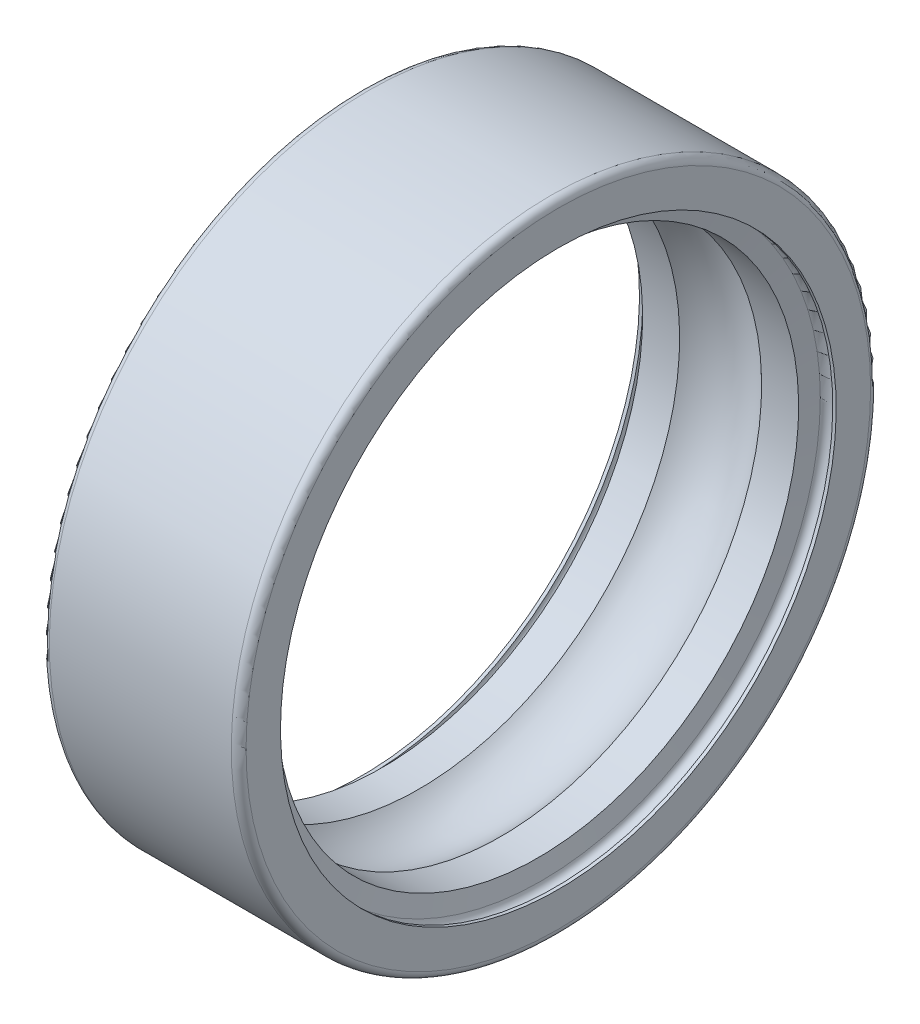
ISO-10303-21;
HEADER;
FILE_DESCRIPTION(('STEP AP214'),'2;1');
FILE_NAME('part.step','',(''),(''),'','','');
FILE_SCHEMA(('AUTOMOTIVE_DESIGN { 1 0 10303 214 1 1 1 1 }'));
ENDSEC;
DATA;
#1=APPLICATION_CONTEXT('core data for automotive mechanical design processes');
#2=APPLICATION_PROTOCOL_DEFINITION('international standard','automotive_design',2000,#1);
#3=PRODUCT_CONTEXT('',#1,'mechanical');
#4=PRODUCT('Part','Part','',(#3));
#5=PRODUCT_RELATED_PRODUCT_CATEGORY('part','',(#4));
#6=PRODUCT_DEFINITION_FORMATION('','',#4);
#7=PRODUCT_DEFINITION_CONTEXT('part definition',#1,'design');
#8=PRODUCT_DEFINITION('design','',#6,#7);
#9=PRODUCT_DEFINITION_SHAPE('','',#8);
#10=(LENGTH_UNIT() NAMED_UNIT(*) SI_UNIT(.MILLI.,.METRE.));
#11=(NAMED_UNIT(*) PLANE_ANGLE_UNIT() SI_UNIT($,.RADIAN.));
#12=(NAMED_UNIT(*) SI_UNIT($,.STERADIAN.) SOLID_ANGLE_UNIT());
#13=UNCERTAINTY_MEASURE_WITH_UNIT(LENGTH_MEASURE(1.E-05),#10,'distance_accuracy_value','');
#14=(GEOMETRIC_REPRESENTATION_CONTEXT(3) GLOBAL_UNCERTAINTY_ASSIGNED_CONTEXT((#13)) GLOBAL_UNIT_ASSIGNED_CONTEXT((#10,
#11,#12)) REPRESENTATION_CONTEXT('',''));
#15=CARTESIAN_POINT('',(0.,0.,0.));
#16=DIRECTION('',(0.,0.,1.));
#17=DIRECTION('',(1.,0.,0.));
#18=AXIS2_PLACEMENT_3D('',#15,#16,#17);
#19=CARTESIAN_POINT('',(7.58,0.,0.));
#20=DIRECTION('',(1.,0.,0.));
#21=DIRECTION('',(0.,0.,-1.));
#22=AXIS2_PLACEMENT_3D('',#19,#20,#21);
#23=TOROIDAL_SURFACE('',#22,11.3,0.28);
#24=CARTESIAN_POINT('',(7.86,0.,0.));
#25=DIRECTION('',(1.,0.,0.));
#26=DIRECTION('',(0.,1.,0.));
#27=AXIS2_PLACEMENT_3D('',#24,#25,#26);
#28=CIRCLE('',#27,11.3);
#29=CARTESIAN_POINT('',(7.86,11.3,0.));
#30=VERTEX_POINT('',#29);
#31=EDGE_CURVE('E11',#30,#30,#28,.T.);
#32=ORIENTED_EDGE('',*,*,#31,.T.);
#33=EDGE_LOOP('',(#32));
#34=FACE_BOUND('',#33,.T.);
#35=CARTESIAN_POINT('',(7.30425382915658,0.,0.));
#36=DIRECTION('',(1.,0.,0.));
#37=DIRECTION('',(0.,1.,0.));
#38=AXIS2_PLACEMENT_3D('',#35,#36,#37);
#39=CIRCLE('',#38,11.3486214897467);
#40=CARTESIAN_POINT('',(7.30425382915658,11.3486214897467,0.));
#41=VERTEX_POINT('',#40);
#42=EDGE_CURVE('E67',#41,#41,#39,.T.);
#43=ORIENTED_EDGE('',*,*,#42,.F.);
#44=EDGE_LOOP('',(#43));
#45=FACE_BOUND('',#44,.T.);
#46=ADVANCED_FACE('F16',(#34,#45),#23,.F.);
#47=CARTESIAN_POINT('',(7.93,0.,0.));
#48=DIRECTION('',(-1.,0.,0.));
#49=DIRECTION('',(0.,1.,0.));
#50=AXIS2_PLACEMENT_3D('',#47,#48,#49);
#51=CYLINDRICAL_SURFACE('',#50,11.3);
#52=CARTESIAN_POINT('',(8.,0.,0.));
#53=DIRECTION('',(1.,0.,0.));
#54=DIRECTION('',(0.,1.,0.));
#55=AXIS2_PLACEMENT_3D('',#52,#53,#54);
#56=CIRCLE('',#55,11.3);
#57=CARTESIAN_POINT('',(8.,11.3,0.));
#58=VERTEX_POINT('',#57);
#59=EDGE_CURVE('E26',#58,#58,#56,.T.);
#60=ORIENTED_EDGE('',*,*,#59,.T.);
#61=EDGE_LOOP('',(#60));
#62=FACE_BOUND('',#61,.T.);
#63=ORIENTED_EDGE('',*,*,#31,.F.);
#64=EDGE_LOOP('',(#63));
#65=FACE_BOUND('',#64,.T.);
#66=ADVANCED_FACE('F96',(#62,#65),#51,.F.);
#67=CARTESIAN_POINT('',(8.,12.,0.));
#68=DIRECTION('',(1.,0.,0.));
#69=DIRECTION('',(0.,1.,0.));
#70=AXIS2_PLACEMENT_3D('',#67,#68,#69);
#71=PLANE('',#70);
#72=CARTESIAN_POINT('',(8.,0.,0.));
#73=DIRECTION('',(1.,0.,0.));
#74=DIRECTION('',(0.,1.,0.));
#75=AXIS2_PLACEMENT_3D('',#72,#73,#74);
#76=CIRCLE('',#75,12.7);
#77=CARTESIAN_POINT('',(8.,12.7,0.));
#78=VERTEX_POINT('',#77);
#79=EDGE_CURVE('E91',#78,#78,#76,.T.);
#80=ORIENTED_EDGE('',*,*,#79,.T.);
#81=EDGE_LOOP('',(#80));
#82=FACE_BOUND('',#81,.T.);
#83=ORIENTED_EDGE('',*,*,#59,.F.);
#84=EDGE_LOOP('',(#83));
#85=FACE_BOUND('',#84,.T.);
#86=ADVANCED_FACE('F18',(#82,#85),#71,.T.);
#87=CARTESIAN_POINT('',(7.7,0.,0.));
#88=DIRECTION('',(1.,0.,0.));
#89=DIRECTION('',(0.,0.,-1.));
#90=AXIS2_PLACEMENT_3D('',#87,#88,#89);
#91=TOROIDAL_SURFACE('',#90,12.7,0.3);
#92=CARTESIAN_POINT('',(7.7,0.,0.));
#93=DIRECTION('',(1.,0.,0.));
#94=DIRECTION('',(0.,1.,0.));
#95=AXIS2_PLACEMENT_3D('',#92,#93,#94);
#96=CIRCLE('',#95,13.);
#97=CARTESIAN_POINT('',(7.7,13.,0.));
#98=VERTEX_POINT('',#97);
#99=EDGE_CURVE('E82',#98,#98,#96,.T.);
#100=ORIENTED_EDGE('',*,*,#99,.T.);
#101=EDGE_LOOP('',(#100));
#102=FACE_BOUND('',#101,.T.);
#103=ORIENTED_EDGE('',*,*,#79,.F.);
#104=EDGE_LOOP('',(#103));
#105=FACE_BOUND('',#104,.T.);
#106=ADVANCED_FACE('F100',(#102,#105),#91,.T.);
#107=CARTESIAN_POINT('',(4.,0.,0.));
#108=DIRECTION('',(-1.,0.,0.));
#109=DIRECTION('',(0.,1.,0.));
#110=AXIS2_PLACEMENT_3D('',#107,#108,#109);
#111=CYLINDRICAL_SURFACE('',#110,13.);
#112=CARTESIAN_POINT('',(0.3,0.,0.));
#113=DIRECTION('',(1.,0.,0.));
#114=DIRECTION('',(0.,1.,0.));
#115=AXIS2_PLACEMENT_3D('',#112,#113,#114);
#116=CIRCLE('',#115,13.);
#117=CARTESIAN_POINT('',(0.3,13.,0.));
#118=VERTEX_POINT('',#117);
#119=EDGE_CURVE('E80',#118,#118,#116,.T.);
#120=ORIENTED_EDGE('',*,*,#119,.T.);
#121=EDGE_LOOP('',(#120));
#122=FACE_BOUND('',#121,.T.);
#123=ORIENTED_EDGE('',*,*,#99,.F.);
#124=EDGE_LOOP('',(#123));
#125=FACE_BOUND('',#124,.T.);
#126=ADVANCED_FACE('F107',(#122,#125),#111,.T.);
#127=CARTESIAN_POINT('',(0.3,0.,0.));
#128=DIRECTION('',(1.,0.,0.));
#129=DIRECTION('',(0.,0.,-1.));
#130=AXIS2_PLACEMENT_3D('',#127,#128,#129);
#131=TOROIDAL_SURFACE('',#130,12.7,0.3);
#132=CARTESIAN_POINT('',(0.,0.,0.));
#133=DIRECTION('',(1.,0.,0.));
#134=DIRECTION('',(0.,1.,0.));
#135=AXIS2_PLACEMENT_3D('',#132,#133,#134);
#136=CIRCLE('',#135,12.7);
#137=CARTESIAN_POINT('',(0.,12.7,0.));
#138=VERTEX_POINT('',#137);
#139=EDGE_CURVE('E77',#138,#138,#136,.T.);
#140=ORIENTED_EDGE('',*,*,#139,.T.);
#141=EDGE_LOOP('',(#140));
#142=FACE_BOUND('',#141,.T.);
#143=ORIENTED_EDGE('',*,*,#119,.F.);
#144=EDGE_LOOP('',(#143));
#145=FACE_BOUND('',#144,.T.);
#146=ADVANCED_FACE('F116',(#142,#145),#131,.T.);
#147=CARTESIAN_POINT('',(0.,12.,0.));
#148=DIRECTION('',(-1.,0.,0.));
#149=DIRECTION('',(0.,-1.,0.));
#150=AXIS2_PLACEMENT_3D('',#147,#148,#149);
#151=PLANE('',#150);
#152=CARTESIAN_POINT('',(0.,0.,0.));
#153=DIRECTION('',(1.,0.,0.));
#154=DIRECTION('',(0.,1.,0.));
#155=AXIS2_PLACEMENT_3D('',#152,#153,#154);
#156=CIRCLE('',#155,11.3);
#157=CARTESIAN_POINT('',(0.,11.3,0.));
#158=VERTEX_POINT('',#157);
#159=EDGE_CURVE('E89',#158,#158,#156,.T.);
#160=ORIENTED_EDGE('',*,*,#159,.T.);
#161=EDGE_LOOP('',(#160));
#162=FACE_BOUND('',#161,.T.);
#163=ORIENTED_EDGE('',*,*,#139,.F.);
#164=EDGE_LOOP('',(#163));
#165=FACE_BOUND('',#164,.T.);
#166=ADVANCED_FACE('F118',(#162,#165),#151,.T.);
#167=CARTESIAN_POINT('',(0.07,0.,0.));
#168=DIRECTION('',(-1.,0.,0.));
#169=DIRECTION('',(0.,1.,0.));
#170=AXIS2_PLACEMENT_3D('',#167,#168,#169);
#171=CYLINDRICAL_SURFACE('',#170,11.3);
#172=CARTESIAN_POINT('',(0.14,0.,0.));
#173=DIRECTION('',(1.,0.,0.));
#174=DIRECTION('',(0.,1.,0.));
#175=AXIS2_PLACEMENT_3D('',#172,#173,#174);
#176=CIRCLE('',#175,11.3);
#177=CARTESIAN_POINT('',(0.14,11.3,0.));
#178=VERTEX_POINT('',#177);
#179=EDGE_CURVE('E87',#178,#178,#176,.T.);
#180=ORIENTED_EDGE('',*,*,#179,.T.);
#181=EDGE_LOOP('',(#180));
#182=FACE_BOUND('',#181,.T.);
#183=ORIENTED_EDGE('',*,*,#159,.F.);
#184=EDGE_LOOP('',(#183));
#185=FACE_BOUND('',#184,.T.);
#186=ADVANCED_FACE('F122',(#182,#185),#171,.F.);
#187=CARTESIAN_POINT('',(0.42,0.,0.));
#188=DIRECTION('',(1.,0.,0.));
#189=DIRECTION('',(0.,0.,-1.));
#190=AXIS2_PLACEMENT_3D('',#187,#188,#189);
#191=TOROIDAL_SURFACE('',#190,11.3,0.28);
#192=CARTESIAN_POINT('',(0.695746170843419,0.,0.));
#193=DIRECTION('',(1.,0.,0.));
#194=DIRECTION('',(0.,1.,0.));
#195=AXIS2_PLACEMENT_3D('',#192,#193,#194);
#196=CIRCLE('',#195,11.3486214897467);
#197=CARTESIAN_POINT('',(0.695746170843419,11.3486214897467,0.));
#198=VERTEX_POINT('',#197);
#199=EDGE_CURVE('E85',#198,#198,#196,.T.);
#200=ORIENTED_EDGE('',*,*,#199,.T.);
#201=EDGE_LOOP('',(#200));
#202=FACE_BOUND('',#201,.T.);
#203=ORIENTED_EDGE('',*,*,#179,.F.);
#204=EDGE_LOOP('',(#203));
#205=FACE_BOUND('',#204,.T.);
#206=ADVANCED_FACE('F132',(#202,#205),#191,.F.);
#207=CARTESIAN_POINT('',(0.761747254333677,0.,0.));
#208=DIRECTION('',(-1.,0.,0.));
#209=DIRECTION('',(0.,1.,0.));
#210=AXIS2_PLACEMENT_3D('',#207,#208,#209);
#211=CONICAL_SURFACE('',#210,10.9743107448734,1.39626340159546);
#212=CARTESIAN_POINT('',(0.827748337823935,0.,0.));
#213=DIRECTION('',(1.,0.,0.));
#214=DIRECTION('',(0.,1.,0.));
#215=AXIS2_PLACEMENT_3D('',#212,#213,#214);
#216=CIRCLE('',#215,10.6);
#217=CARTESIAN_POINT('',(0.827748337823935,10.6,0.));
#218=VERTEX_POINT('',#217);
#219=EDGE_CURVE('E79',#218,#218,#216,.T.);
#220=ORIENTED_EDGE('',*,*,#219,.T.);
#221=EDGE_LOOP('',(#220));
#222=FACE_BOUND('',#221,.T.);
#223=ORIENTED_EDGE('',*,*,#199,.F.);
#224=EDGE_LOOP('',(#223));
#225=FACE_BOUND('',#224,.T.);
#226=ADVANCED_FACE('F136',(#222,#225),#211,.F.);
#227=CARTESIAN_POINT('',(1.58033337806847,0.,0.));
#228=DIRECTION('',(-1.,0.,0.));
#229=DIRECTION('',(0.,1.,0.));
#230=AXIS2_PLACEMENT_3D('',#227,#228,#229);
#231=CYLINDRICAL_SURFACE('',#230,10.6);
#232=CARTESIAN_POINT('',(2.33291841831301,0.,0.));
#233=DIRECTION('',(1.,0.,0.));
#234=DIRECTION('',(0.,1.,0.));
#235=AXIS2_PLACEMENT_3D('',#232,#233,#234);
#236=CIRCLE('',#235,10.6);
#237=CARTESIAN_POINT('',(2.33291841831301,10.6,0.));
#238=VERTEX_POINT('',#237);
#239=EDGE_CURVE('E73',#238,#238,#236,.T.);
#240=ORIENTED_EDGE('',*,*,#239,.T.);
#241=EDGE_LOOP('',(#240));
#242=FACE_BOUND('',#241,.T.);
#243=ORIENTED_EDGE('',*,*,#219,.F.);
#244=EDGE_LOOP('',(#243));
#245=FACE_BOUND('',#244,.T.);
#246=ADVANCED_FACE('F145',(#242,#245),#231,.F.);
#247=CARTESIAN_POINT('',(4.,0.,0.));
#248=DIRECTION('',(1.,0.,0.));
#249=DIRECTION('',(0.,0.,-1.));
#250=AXIS2_PLACEMENT_3D('',#247,#248,#249);
#251=TOROIDAL_SURFACE('',#250,8.9,2.381);
#252=CARTESIAN_POINT('',(5.66708158168699,0.,0.));
#253=DIRECTION('',(1.,0.,0.));
#254=DIRECTION('',(0.,1.,0.));
#255=AXIS2_PLACEMENT_3D('',#252,#253,#254);
#256=CIRCLE('',#255,10.6);
#257=CARTESIAN_POINT('',(5.66708158168699,10.6,0.));
#258=VERTEX_POINT('',#257);
#259=EDGE_CURVE('E71',#258,#258,#256,.T.);
#260=ORIENTED_EDGE('',*,*,#259,.T.);
#261=EDGE_LOOP('',(#260));
#262=FACE_BOUND('',#261,.T.);
#263=ORIENTED_EDGE('',*,*,#239,.F.);
#264=EDGE_LOOP('',(#263));
#265=FACE_BOUND('',#264,.T.);
#266=ADVANCED_FACE('F128',(#262,#265),#251,.F.);
#267=CARTESIAN_POINT('',(6.41966662193153,0.,0.));
#268=DIRECTION('',(-1.,0.,0.));
#269=DIRECTION('',(0.,1.,0.));
#270=AXIS2_PLACEMENT_3D('',#267,#268,#269);
#271=CYLINDRICAL_SURFACE('',#270,10.6);
#272=CARTESIAN_POINT('',(7.17225166217606,0.,0.));
#273=DIRECTION('',(1.,0.,0.));
#274=DIRECTION('',(0.,1.,0.));
#275=AXIS2_PLACEMENT_3D('',#272,#273,#274);
#276=CIRCLE('',#275,10.6);
#277=CARTESIAN_POINT('',(7.17225166217606,10.6,0.));
#278=VERTEX_POINT('',#277);
#279=EDGE_CURVE('E20',#278,#278,#276,.T.);
#280=ORIENTED_EDGE('',*,*,#279,.T.);
#281=EDGE_LOOP('',(#280));
#282=FACE_BOUND('',#281,.T.);
#283=ORIENTED_EDGE('',*,*,#259,.F.);
#284=EDGE_LOOP('',(#283));
#285=FACE_BOUND('',#284,.T.);
#286=ADVANCED_FACE('F125',(#282,#285),#271,.F.);
#287=CARTESIAN_POINT('',(7.23825274566632,0.,0.));
#288=DIRECTION('',(1.,0.,0.));
#289=DIRECTION('',(0.,1.,0.));
#290=AXIS2_PLACEMENT_3D('',#287,#288,#289);
#291=CONICAL_SURFACE('',#290,10.9743107448734,1.39626340159546);
#292=ORIENTED_EDGE('',*,*,#42,.T.);
#293=EDGE_LOOP('',(#292));
#294=FACE_BOUND('',#293,.T.);
#295=ORIENTED_EDGE('',*,*,#279,.F.);
#296=EDGE_LOOP('',(#295));
#297=FACE_BOUND('',#296,.T.);
#298=ADVANCED_FACE('F68',(#294,#297),#291,.F.);
#299=CLOSED_SHELL('',(#46,#66,#86,#106,#126,#146,#166,#186,#206,#226,#246,#266,#286,#298));
#300=MANIFOLD_SOLID_BREP('B1',#299);
#301=ADVANCED_BREP_SHAPE_REPRESENTATION('',(#18,#300),#14);
#302=SHAPE_DEFINITION_REPRESENTATION(#9,#301);
ENDSEC;
END-ISO-10303-21;
